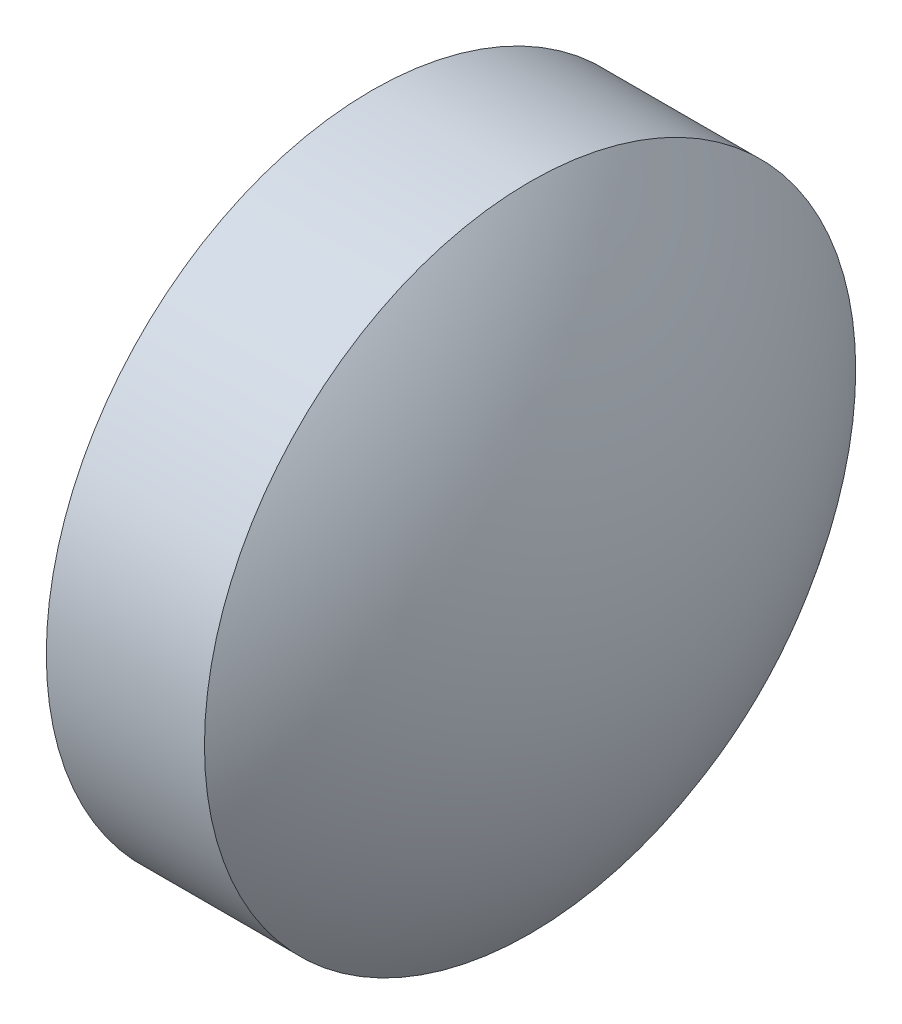
ISO-10303-21;
HEADER;
FILE_DESCRIPTION(('STEP AP214'),'2;1');
FILE_NAME('part.step','',(''),(''),'','','');
FILE_SCHEMA(('AUTOMOTIVE_DESIGN { 1 0 10303 214 1 1 1 1 }'));
ENDSEC;
DATA;
#1=APPLICATION_CONTEXT('core data for automotive mechanical design processes');
#2=APPLICATION_PROTOCOL_DEFINITION('international standard','automotive_design',2000,#1);
#3=PRODUCT_CONTEXT('',#1,'mechanical');
#4=PRODUCT('Part','Part','',(#3));
#5=PRODUCT_RELATED_PRODUCT_CATEGORY('part','',(#4));
#6=PRODUCT_DEFINITION_FORMATION('','',#4);
#7=PRODUCT_DEFINITION_CONTEXT('part definition',#1,'design');
#8=PRODUCT_DEFINITION('design','',#6,#7);
#9=PRODUCT_DEFINITION_SHAPE('','',#8);
#10=(LENGTH_UNIT() NAMED_UNIT(*) SI_UNIT(.MILLI.,.METRE.));
#11=(NAMED_UNIT(*) PLANE_ANGLE_UNIT() SI_UNIT($,.RADIAN.));
#12=(NAMED_UNIT(*) SI_UNIT($,.STERADIAN.) SOLID_ANGLE_UNIT());
#13=UNCERTAINTY_MEASURE_WITH_UNIT(LENGTH_MEASURE(1.E-05),#10,'distance_accuracy_value','');
#14=(GEOMETRIC_REPRESENTATION_CONTEXT(3) GLOBAL_UNCERTAINTY_ASSIGNED_CONTEXT((#13)) GLOBAL_UNIT_ASSIGNED_CONTEXT((#10,
#11,#12)) REPRESENTATION_CONTEXT('',''));
#15=CARTESIAN_POINT('',(0.,0.,0.));
#16=DIRECTION('',(0.,0.,1.));
#17=DIRECTION('',(1.,0.,0.));
#18=AXIS2_PLACEMENT_3D('',#15,#16,#17);
#19=CARTESIAN_POINT('',(349.000366236258,25.0479147720055,0.));
#20=DIRECTION('',(-1.,0.,0.));
#21=DIRECTION('',(0.,1.,0.));
#22=AXIS2_PLACEMENT_3D('',#19,#20,#21);
#23=SPHERICAL_SURFACE('',#22,5.17165781477665);
#24=CARTESIAN_POINT('',(353.102017678439,25.0479147720055,0.));
#25=DIRECTION('',(-1.,0.,0.));
#26=DIRECTION('',(0.,0.,1.));
#27=AXIS2_PLACEMENT_3D('',#24,#25,#26);
#28=CIRCLE('',#27,3.15);
#29=CARTESIAN_POINT('',(353.102017678439,25.0479147720055,3.15));
#30=VERTEX_POINT('',#29);
#31=EDGE_CURVE('E10',#30,#30,#28,.T.);
#32=ORIENTED_EDGE('',*,*,#31,.F.);
#33=EDGE_LOOP('',(#32));
#34=FACE_BOUND('',#33,.T.);
#35=ADVANCED_FACE('F35',(#34),#23,.T.);
#36=CARTESIAN_POINT('',(350.710389508854,25.0479147720055,0.));
#37=DIRECTION('',(-1.,0.,0.));
#38=DIRECTION('',(0.,0.,1.));
#39=AXIS2_PLACEMENT_3D('',#36,#37,#38);
#40=CYLINDRICAL_SURFACE('',#39,3.15);
#41=CARTESIAN_POINT('',(351.572017678439,25.0479147720055,0.));
#42=DIRECTION('',(-1.,0.,0.));
#43=DIRECTION('',(0.,0.,1.));
#44=AXIS2_PLACEMENT_3D('',#41,#42,#43);
#45=CIRCLE('',#44,3.15);
#46=CARTESIAN_POINT('',(351.572017678439,25.0479147720055,3.15));
#47=VERTEX_POINT('',#46);
#48=EDGE_CURVE('E41',#47,#47,#45,.T.);
#49=ORIENTED_EDGE('',*,*,#48,.F.);
#50=EDGE_LOOP('',(#49));
#51=FACE_BOUND('',#50,.T.);
#52=ORIENTED_EDGE('',*,*,#31,.T.);
#53=EDGE_LOOP('',(#52));
#54=FACE_BOUND('',#53,.T.);
#55=ADVANCED_FACE('F49',(#51,#54),#40,.T.);
#56=CARTESIAN_POINT('',(351.572017678439,25.0479147720055,0.));
#57=DIRECTION('',(1.,0.,0.));
#58=DIRECTION('',(0.,0.,-1.));
#59=AXIS2_PLACEMENT_3D('',#56,#57,#58);
#60=PLANE('',#59);
#61=ORIENTED_EDGE('',*,*,#48,.T.);
#62=EDGE_LOOP('',(#61));
#63=FACE_BOUND('',#62,.T.);
#64=ADVANCED_FACE('F47',(#63),#60,.F.);
#65=CLOSED_SHELL('',(#35,#55,#64));
#66=MANIFOLD_SOLID_BREP('B2',#65);
#67=ADVANCED_BREP_SHAPE_REPRESENTATION('',(#18,#66),#14);
#68=SHAPE_DEFINITION_REPRESENTATION(#9,#67);
ENDSEC;
END-ISO-10303-21;
